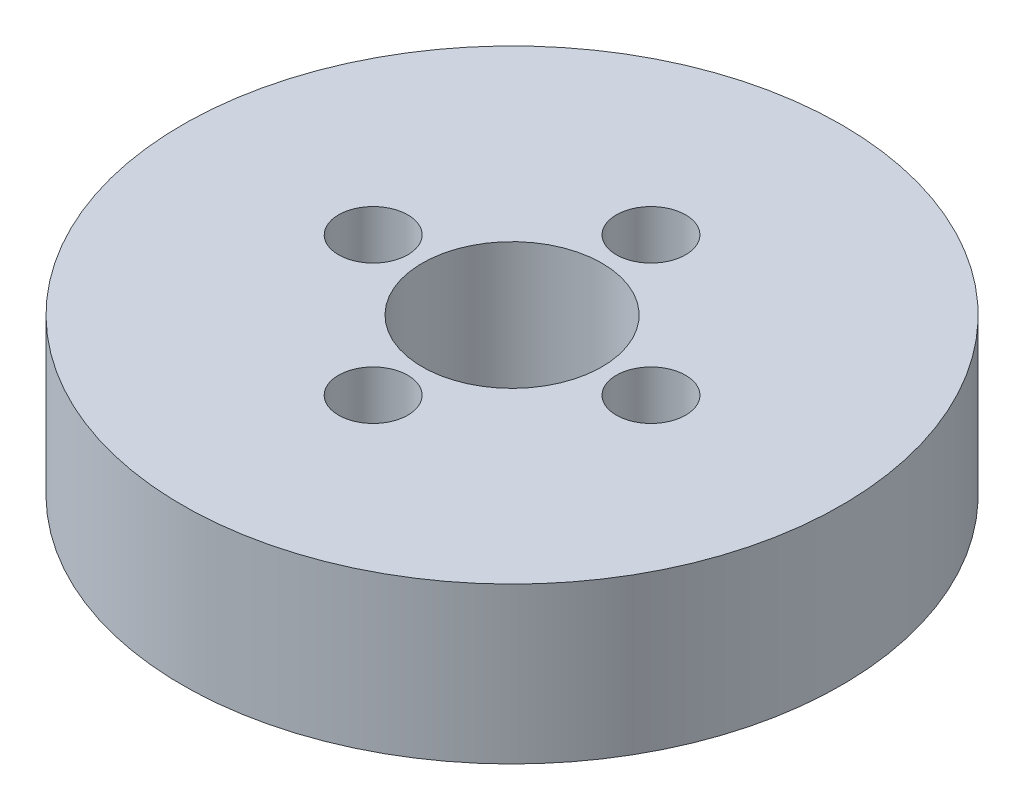
ISO-10303-21;
HEADER;
FILE_DESCRIPTION(('STEP AP214'),'2;1');
FILE_NAME('part.step','',(''),(''),'','','');
FILE_SCHEMA(('AUTOMOTIVE_DESIGN { 1 0 10303 214 1 1 1 1 }'));
ENDSEC;
DATA;
#1=APPLICATION_CONTEXT('core data for automotive mechanical design processes');
#2=APPLICATION_PROTOCOL_DEFINITION('international standard','automotive_design',2000,#1);
#3=PRODUCT_CONTEXT('',#1,'mechanical');
#4=PRODUCT('Part','Part','',(#3));
#5=PRODUCT_RELATED_PRODUCT_CATEGORY('part','',(#4));
#6=PRODUCT_DEFINITION_FORMATION('','',#4);
#7=PRODUCT_DEFINITION_CONTEXT('part definition',#1,'design');
#8=PRODUCT_DEFINITION('design','',#6,#7);
#9=PRODUCT_DEFINITION_SHAPE('','',#8);
#10=(LENGTH_UNIT() NAMED_UNIT(*) SI_UNIT(.MILLI.,.METRE.));
#11=(NAMED_UNIT(*) PLANE_ANGLE_UNIT() SI_UNIT($,.RADIAN.));
#12=(NAMED_UNIT(*) SI_UNIT($,.STERADIAN.) SOLID_ANGLE_UNIT());
#13=UNCERTAINTY_MEASURE_WITH_UNIT(LENGTH_MEASURE(1.E-05),#10,'distance_accuracy_value','');
#14=(GEOMETRIC_REPRESENTATION_CONTEXT(3) GLOBAL_UNCERTAINTY_ASSIGNED_CONTEXT((#13)) GLOBAL_UNIT_ASSIGNED_CONTEXT((#10,
#11,#12)) REPRESENTATION_CONTEXT('',''));
#15=CARTESIAN_POINT('',(0.,0.,0.));
#16=DIRECTION('',(0.,0.,1.));
#17=DIRECTION('',(1.,0.,0.));
#18=AXIS2_PLACEMENT_3D('',#15,#16,#17);
#19=CARTESIAN_POINT('',(0.,26.,0.));
#20=DIRECTION('',(0.,-1.,0.));
#21=DIRECTION('',(0.,0.,-1.));
#22=AXIS2_PLACEMENT_3D('',#19,#20,#21);
#23=CYLINDRICAL_SURFACE('',#22,55.);
#24=CARTESIAN_POINT('',(0.,26.,0.));
#25=DIRECTION('',(0.,1.,0.));
#26=DIRECTION('',(0.,0.,1.));
#27=AXIS2_PLACEMENT_3D('',#24,#25,#26);
#28=CIRCLE('',#27,55.);
#29=CARTESIAN_POINT('',(0.,26.,-55.));
#30=VERTEX_POINT('',#29);
#31=EDGE_CURVE('E10',#30,#30,#28,.T.);
#32=CARTESIAN_POINT('',(0.,0.,0.));
#33=DIRECTION('',(0.,1.,0.));
#34=DIRECTION('',(0.,0.,1.));
#35=AXIS2_PLACEMENT_3D('',#32,#33,#34);
#36=CIRCLE('',#35,55.);
#37=CARTESIAN_POINT('',(0.,0.,-55.));
#38=VERTEX_POINT('',#37);
#39=EDGE_CURVE('E37',#38,#38,#36,.T.);
#40=CARTESIAN_POINT('',(0.,26.,-55.));
#41=CARTESIAN_POINT('',(0.,25.7291666666667,-55.));
#42=CARTESIAN_POINT('',(0.,25.4583333333333,-55.));
#43=CARTESIAN_POINT('',(0.,24.9166666666667,-55.));
#44=CARTESIAN_POINT('',(0.,24.6458333333333,-55.));
#45=CARTESIAN_POINT('',(0.,24.1041666666667,-55.));
#46=CARTESIAN_POINT('',(0.,23.8333333333333,-55.));
#47=CARTESIAN_POINT('',(0.,23.2916666666667,-55.));
#48=CARTESIAN_POINT('',(0.,23.0208333333333,-55.));
#49=CARTESIAN_POINT('',(0.,22.4791666666667,-55.));
#50=CARTESIAN_POINT('',(0.,22.2083333333333,-55.));
#51=CARTESIAN_POINT('',(0.,21.6666666666667,-55.));
#52=CARTESIAN_POINT('',(0.,21.3958333333333,-55.));
#53=CARTESIAN_POINT('',(0.,20.8541666666667,-55.));
#54=CARTESIAN_POINT('',(0.,20.5833333333333,-55.));
#55=CARTESIAN_POINT('',(0.,20.0416666666667,-55.));
#56=CARTESIAN_POINT('',(0.,19.7708333333333,-55.));
#57=CARTESIAN_POINT('',(0.,19.2291666666667,-55.));
#58=CARTESIAN_POINT('',(0.,18.9583333333333,-55.));
#59=CARTESIAN_POINT('',(0.,18.4166666666667,-55.));
#60=CARTESIAN_POINT('',(0.,18.1458333333333,-55.));
#61=CARTESIAN_POINT('',(0.,17.6041666666667,-55.));
#62=CARTESIAN_POINT('',(0.,17.3333333333333,-55.));
#63=CARTESIAN_POINT('',(0.,16.7916666666667,-55.));
#64=CARTESIAN_POINT('',(0.,16.5208333333333,-55.));
#65=CARTESIAN_POINT('',(0.,15.9791666666667,-55.));
#66=CARTESIAN_POINT('',(0.,15.7083333333333,-55.));
#67=CARTESIAN_POINT('',(0.,15.1666666666667,-55.));
#68=CARTESIAN_POINT('',(0.,14.8958333333333,-55.));
#69=CARTESIAN_POINT('',(0.,14.3541666666667,-55.));
#70=CARTESIAN_POINT('',(0.,14.0833333333333,-55.));
#71=CARTESIAN_POINT('',(0.,13.5416666666667,-55.));
#72=CARTESIAN_POINT('',(0.,13.2708333333333,-55.));
#73=CARTESIAN_POINT('',(0.,12.7291666666667,-55.));
#74=CARTESIAN_POINT('',(0.,12.4583333333333,-55.));
#75=CARTESIAN_POINT('',(0.,11.9166666666667,-55.));
#76=CARTESIAN_POINT('',(0.,11.6458333333333,-55.));
#77=CARTESIAN_POINT('',(0.,11.1041666666667,-55.));
#78=CARTESIAN_POINT('',(0.,10.8333333333333,-55.));
#79=CARTESIAN_POINT('',(0.,10.2916666666667,-55.));
#80=CARTESIAN_POINT('',(0.,10.0208333333333,-55.));
#81=CARTESIAN_POINT('',(0.,9.47916666666667,-55.));
#82=CARTESIAN_POINT('',(0.,9.20833333333333,-55.));
#83=CARTESIAN_POINT('',(0.,8.66666666666667,-55.));
#84=CARTESIAN_POINT('',(0.,8.39583333333333,-55.));
#85=CARTESIAN_POINT('',(0.,7.85416666666667,-55.));
#86=CARTESIAN_POINT('',(0.,7.58333333333333,-55.));
#87=CARTESIAN_POINT('',(0.,7.04166666666667,-55.));
#88=CARTESIAN_POINT('',(0.,6.77083333333333,-55.));
#89=CARTESIAN_POINT('',(0.,6.22916666666667,-55.));
#90=CARTESIAN_POINT('',(0.,5.95833333333333,-55.));
#91=CARTESIAN_POINT('',(0.,5.41666666666667,-55.));
#92=CARTESIAN_POINT('',(0.,5.14583333333333,-55.));
#93=CARTESIAN_POINT('',(0.,4.60416666666667,-55.));
#94=CARTESIAN_POINT('',(0.,4.33333333333333,-55.));
#95=CARTESIAN_POINT('',(0.,3.79166666666667,-55.));
#96=CARTESIAN_POINT('',(0.,3.52083333333333,-55.));
#97=CARTESIAN_POINT('',(0.,2.97916666666667,-55.));
#98=CARTESIAN_POINT('',(0.,2.70833333333333,-55.));
#99=CARTESIAN_POINT('',(0.,2.16666666666667,-55.));
#100=CARTESIAN_POINT('',(0.,1.89583333333333,-55.));
#101=CARTESIAN_POINT('',(0.,1.35416666666667,-55.));
#102=CARTESIAN_POINT('',(0.,1.08333333333333,-55.));
#103=CARTESIAN_POINT('',(0.,0.541666666666667,-55.));
#104=CARTESIAN_POINT('',(0.,0.270833333333334,-55.));
#105=CARTESIAN_POINT('',(0.,0.,-55.));
#106=B_SPLINE_CURVE_WITH_KNOTS('',3,(#40,#41,#42,#43,#44,#45,#46,#47,#48,#49,#50,#51,#52,#53,
#54,#55,#56,#57,#58,#59,#60,#61,#62,#63,#64,#65,#66,#67,#68,#69,#70,#71,#72,#73,#74,#75,#76,#77,
#78,#79,#80,#81,#82,#83,#84,#85,#86,#87,#88,#89,#90,#91,#92,#93,#94,#95,#96,#97,#98,#99,#100,
#101,#102,#103,#104,#105),.UNSPECIFIED.,.F.,.F.,(4,2,2,2,2,2,2,2,2,2,2,2,2,2,2,2,2,2,2,2,2,2,2,
2,2,2,2,2,2,2,2,2,4),(0.,0.812500000000001,1.625,2.4375,3.25,4.0625,4.875,5.6875,6.5,7.3125,
8.125,8.9375,9.75,10.5625,11.375,12.1875,13.,13.8125,14.625,15.4375,16.25,17.0625,17.875,
18.6875,19.5,20.3125,21.125,21.9375,22.75,23.5625,24.375,25.1875,26.),.UNSPECIFIED.);
#107=EDGE_CURVE('BSEAM40',#30,#38,#106,.T.);
#108=ORIENTED_EDGE('',*,*,#31,.F.);
#109=ORIENTED_EDGE('',*,*,#39,.T.);
#110=ORIENTED_EDGE('',*,*,#107,.T.);
#111=ORIENTED_EDGE('',*,*,#107,.F.);
#112=EDGE_LOOP('',(#108,#110,#109,#111));
#113=FACE_BOUND('',#112,.T.);
#114=ADVANCED_FACE('F40',(#113),#23,.T.);
#115=CARTESIAN_POINT('',(0.,26.,0.));
#116=DIRECTION('',(0.,1.,0.));
#117=DIRECTION('',(0.,0.,1.));
#118=AXIS2_PLACEMENT_3D('',#115,#116,#117);
#119=PLANE('',#118);
#120=CARTESIAN_POINT('',(0.,26.,23.1811351570691));
#121=DIRECTION('',(0.,1.,0.));
#122=DIRECTION('',(1.,0.,0.));
#123=AXIS2_PLACEMENT_3D('',#120,#121,#122);
#124=CIRCLE('',#123,5.78191735865765);
#125=CARTESIAN_POINT('',(5.78191735865773,26.,23.1811351570691));
#126=VERTEX_POINT('',#125);
#127=EDGE_CURVE('E71',#126,#126,#124,.T.);
#128=ORIENTED_EDGE('',*,*,#127,.F.);
#129=EDGE_LOOP('',(#128));
#130=FACE_BOUND('',#129,.T.);
#131=CARTESIAN_POINT('',(23.1811351570691,26.,0.));
#132=DIRECTION('',(0.,1.,0.));
#133=DIRECTION('',(0.,0.,-1.));
#134=AXIS2_PLACEMENT_3D('',#131,#132,#133);
#135=CIRCLE('',#134,5.78191735865765);
#136=CARTESIAN_POINT('',(23.1811351570691,26.,-5.78191735865765));
#137=VERTEX_POINT('',#136);
#138=EDGE_CURVE('E70',#137,#137,#135,.T.);
#139=ORIENTED_EDGE('',*,*,#138,.F.);
#140=EDGE_LOOP('',(#139));
#141=FACE_BOUND('',#140,.T.);
#142=CARTESIAN_POINT('',(-2.42809502442321E-13,26.,-23.1811351570691));
#143=DIRECTION('',(0.,1.,0.));
#144=DIRECTION('',(-1.,0.,0.));
#145=AXIS2_PLACEMENT_3D('',#142,#143,#144);
#146=CIRCLE('',#145,5.78191735865765);
#147=CARTESIAN_POINT('',(-5.7819173586579,26.,-23.181135157069));
#148=VERTEX_POINT('',#147);
#149=EDGE_CURVE('E61',#148,#148,#146,.T.);
#150=ORIENTED_EDGE('',*,*,#149,.F.);
#151=EDGE_LOOP('',(#150));
#152=FACE_BOUND('',#151,.T.);
#153=CARTESIAN_POINT('',(-23.1811351570691,26.,0.));
#154=DIRECTION('',(0.,1.,0.));
#155=DIRECTION('',(0.,0.,1.));
#156=AXIS2_PLACEMENT_3D('',#153,#154,#155);
#157=CIRCLE('',#156,5.78191735865765);
#158=CARTESIAN_POINT('',(-23.1811351570691,26.,5.78191735865765));
#159=VERTEX_POINT('',#158);
#160=EDGE_CURVE('E54',#159,#159,#157,.T.);
#161=ORIENTED_EDGE('',*,*,#160,.F.);
#162=EDGE_LOOP('',(#161));
#163=FACE_BOUND('',#162,.T.);
#164=CARTESIAN_POINT('',(0.,26.,0.));
#165=DIRECTION('',(0.,1.,0.));
#166=DIRECTION('',(0.,0.,1.));
#167=AXIS2_PLACEMENT_3D('',#164,#165,#166);
#168=CIRCLE('',#167,15.);
#169=CARTESIAN_POINT('',(0.,26.,-15.));
#170=VERTEX_POINT('',#169);
#171=EDGE_CURVE('E50',#170,#170,#168,.T.);
#172=ORIENTED_EDGE('',*,*,#171,.F.);
#173=EDGE_LOOP('',(#172));
#174=FACE_BOUND('',#173,.T.);
#175=ORIENTED_EDGE('',*,*,#31,.T.);
#176=EDGE_LOOP('',(#175));
#177=FACE_BOUND('',#176,.T.);
#178=ADVANCED_FACE('F86',(#130,#141,#152,#163,#174,#177),#119,.T.);
#179=CARTESIAN_POINT('',(0.,0.,0.));
#180=DIRECTION('',(0.,1.,0.));
#181=DIRECTION('',(0.,0.,1.));
#182=AXIS2_PLACEMENT_3D('',#179,#180,#181);
#183=PLANE('',#182);
#184=CARTESIAN_POINT('',(0.,0.,0.));
#185=DIRECTION('',(0.,1.,0.));
#186=DIRECTION('',(0.,0.,1.));
#187=AXIS2_PLACEMENT_3D('',#184,#185,#186);
#188=CIRCLE('',#187,15.);
#189=CARTESIAN_POINT('',(0.,0.,-15.));
#190=VERTEX_POINT('',#189);
#191=EDGE_CURVE('E47',#190,#190,#188,.T.);
#192=ORIENTED_EDGE('',*,*,#191,.T.);
#193=EDGE_LOOP('',(#192));
#194=FACE_BOUND('',#193,.T.);
#195=ORIENTED_EDGE('',*,*,#39,.F.);
#196=EDGE_LOOP('',(#195));
#197=FACE_BOUND('',#196,.T.);
#198=ADVANCED_FACE('F93',(#194,#197),#183,.F.);
#199=CARTESIAN_POINT('',(0.,26.,0.));
#200=DIRECTION('',(0.,-1.,0.));
#201=DIRECTION('',(0.,0.,-1.));
#202=AXIS2_PLACEMENT_3D('',#199,#200,#201);
#203=CYLINDRICAL_SURFACE('',#202,15.);
#204=CARTESIAN_POINT('',(0.,26.,-15.));
#205=CARTESIAN_POINT('',(0.,25.7291666666667,-15.));
#206=CARTESIAN_POINT('',(0.,25.4583333333333,-15.));
#207=CARTESIAN_POINT('',(0.,24.9166666666667,-15.));
#208=CARTESIAN_POINT('',(0.,24.6458333333333,-15.));
#209=CARTESIAN_POINT('',(0.,24.1041666666667,-15.));
#210=CARTESIAN_POINT('',(0.,23.8333333333333,-15.));
#211=CARTESIAN_POINT('',(0.,23.2916666666667,-15.));
#212=CARTESIAN_POINT('',(0.,23.0208333333333,-15.));
#213=CARTESIAN_POINT('',(0.,22.4791666666667,-15.));
#214=CARTESIAN_POINT('',(0.,22.2083333333333,-15.));
#215=CARTESIAN_POINT('',(0.,21.6666666666667,-15.));
#216=CARTESIAN_POINT('',(0.,21.3958333333333,-15.));
#217=CARTESIAN_POINT('',(0.,20.8541666666667,-15.));
#218=CARTESIAN_POINT('',(0.,20.5833333333333,-15.));
#219=CARTESIAN_POINT('',(0.,20.0416666666667,-15.));
#220=CARTESIAN_POINT('',(0.,19.7708333333333,-15.));
#221=CARTESIAN_POINT('',(0.,19.2291666666667,-15.));
#222=CARTESIAN_POINT('',(0.,18.9583333333333,-15.));
#223=CARTESIAN_POINT('',(0.,18.4166666666667,-15.));
#224=CARTESIAN_POINT('',(0.,18.1458333333333,-15.));
#225=CARTESIAN_POINT('',(0.,17.6041666666667,-15.));
#226=CARTESIAN_POINT('',(0.,17.3333333333333,-15.));
#227=CARTESIAN_POINT('',(0.,16.7916666666667,-15.));
#228=CARTESIAN_POINT('',(0.,16.5208333333333,-15.));
#229=CARTESIAN_POINT('',(0.,15.9791666666667,-15.));
#230=CARTESIAN_POINT('',(0.,15.7083333333333,-15.));
#231=CARTESIAN_POINT('',(0.,15.1666666666667,-15.));
#232=CARTESIAN_POINT('',(0.,14.8958333333333,-15.));
#233=CARTESIAN_POINT('',(0.,14.3541666666667,-15.));
#234=CARTESIAN_POINT('',(0.,14.0833333333333,-15.));
#235=CARTESIAN_POINT('',(0.,13.5416666666667,-15.));
#236=CARTESIAN_POINT('',(0.,13.2708333333333,-15.));
#237=CARTESIAN_POINT('',(0.,12.7291666666667,-15.));
#238=CARTESIAN_POINT('',(0.,12.4583333333333,-15.));
#239=CARTESIAN_POINT('',(0.,11.9166666666667,-15.));
#240=CARTESIAN_POINT('',(0.,11.6458333333333,-15.));
#241=CARTESIAN_POINT('',(0.,11.1041666666667,-15.));
#242=CARTESIAN_POINT('',(0.,10.8333333333333,-15.));
#243=CARTESIAN_POINT('',(0.,10.2916666666667,-15.));
#244=CARTESIAN_POINT('',(0.,10.0208333333333,-15.));
#245=CARTESIAN_POINT('',(0.,9.47916666666667,-15.));
#246=CARTESIAN_POINT('',(0.,9.20833333333333,-15.));
#247=CARTESIAN_POINT('',(0.,8.66666666666667,-15.));
#248=CARTESIAN_POINT('',(0.,8.39583333333333,-15.));
#249=CARTESIAN_POINT('',(0.,7.85416666666667,-15.));
#250=CARTESIAN_POINT('',(0.,7.58333333333333,-15.));
#251=CARTESIAN_POINT('',(0.,7.04166666666667,-15.));
#252=CARTESIAN_POINT('',(0.,6.77083333333333,-15.));
#253=CARTESIAN_POINT('',(0.,6.22916666666667,-15.));
#254=CARTESIAN_POINT('',(0.,5.95833333333333,-15.));
#255=CARTESIAN_POINT('',(0.,5.41666666666667,-15.));
#256=CARTESIAN_POINT('',(0.,5.14583333333333,-15.));
#257=CARTESIAN_POINT('',(0.,4.60416666666667,-15.));
#258=CARTESIAN_POINT('',(0.,4.33333333333333,-15.));
#259=CARTESIAN_POINT('',(0.,3.79166666666667,-15.));
#260=CARTESIAN_POINT('',(0.,3.52083333333333,-15.));
#261=CARTESIAN_POINT('',(0.,2.97916666666667,-15.));
#262=CARTESIAN_POINT('',(0.,2.70833333333333,-15.));
#263=CARTESIAN_POINT('',(0.,2.16666666666667,-15.));
#264=CARTESIAN_POINT('',(0.,1.89583333333333,-15.));
#265=CARTESIAN_POINT('',(0.,1.35416666666667,-15.));
#266=CARTESIAN_POINT('',(0.,1.08333333333333,-15.));
#267=CARTESIAN_POINT('',(0.,0.541666666666667,-15.));
#268=CARTESIAN_POINT('',(0.,0.270833333333334,-15.));
#269=CARTESIAN_POINT('',(0.,0.,-15.));
#270=B_SPLINE_CURVE_WITH_KNOTS('',3,(#204,#205,#206,#207,#208,#209,#210,#211,#212,#213,#214,
#215,#216,#217,#218,#219,#220,#221,#222,#223,#224,#225,#226,#227,#228,#229,#230,#231,#232,#233,
#234,#235,#236,#237,#238,#239,#240,#241,#242,#243,#244,#245,#246,#247,#248,#249,#250,#251,#252,
#253,#254,#255,#256,#257,#258,#259,#260,#261,#262,#263,#264,#265,#266,#267,#268,#269),
.UNSPECIFIED.,.F.,.F.,(4,2,2,2,2,2,2,2,2,2,2,2,2,2,2,2,2,2,2,2,2,2,2,2,2,2,2,2,2,2,2,2,4),(0.,
0.812500000000001,1.625,2.4375,3.25,4.0625,4.875,5.6875,6.5,7.3125,8.125,8.9375,9.75,10.5625,
11.375,12.1875,13.,13.8125,14.625,15.4375,16.25,17.0625,17.875,18.6875,19.5,20.3125,21.125,
21.9375,22.75,23.5625,24.375,25.1875,26.),.UNSPECIFIED.);
#271=EDGE_CURVE('BSEAM101',#170,#190,#270,.T.);
#272=ORIENTED_EDGE('',*,*,#171,.T.);
#273=ORIENTED_EDGE('',*,*,#191,.F.);
#274=ORIENTED_EDGE('',*,*,#271,.T.);
#275=ORIENTED_EDGE('',*,*,#271,.F.);
#276=EDGE_LOOP('',(#272,#274,#273,#275));
#277=FACE_BOUND('',#276,.T.);
#278=ADVANCED_FACE('F101',(#277),#203,.F.);
#279=CARTESIAN_POINT('',(-23.1811351570691,1.56405362331572,0.));
#280=DIRECTION('',(0.,1.,0.));
#281=DIRECTION('',(0.,0.,1.));
#282=AXIS2_PLACEMENT_3D('',#279,#280,#281);
#283=CYLINDRICAL_SURFACE('',#282,5.78191735865765);
#284=CARTESIAN_POINT('',(-23.1811351570691,1.56405362331572,0.));
#285=DIRECTION('',(0.,1.,0.));
#286=DIRECTION('',(0.,0.,1.));
#287=AXIS2_PLACEMENT_3D('',#284,#285,#286);
#288=CIRCLE('',#287,5.78191735865765);
#289=CARTESIAN_POINT('',(-23.1811351570691,1.56405362331572,5.78191735865765));
#290=VERTEX_POINT('',#289);
#291=EDGE_CURVE('E55',#290,#290,#288,.T.);
#292=ORIENTED_EDGE('',*,*,#291,.F.);
#293=EDGE_LOOP('',(#292));
#294=FACE_BOUND('',#293,.T.);
#295=ORIENTED_EDGE('',*,*,#160,.T.);
#296=EDGE_LOOP('',(#295));
#297=FACE_BOUND('',#296,.T.);
#298=ADVANCED_FACE('F102',(#294,#297),#283,.F.);
#299=CARTESIAN_POINT('',(-23.1811351570691,1.56405362331572,0.));
#300=DIRECTION('',(0.,1.,0.));
#301=DIRECTION('',(0.,0.,1.));
#302=AXIS2_PLACEMENT_3D('',#299,#300,#301);
#303=PLANE('',#302);
#304=ORIENTED_EDGE('',*,*,#291,.T.);
#305=EDGE_LOOP('',(#304));
#306=FACE_BOUND('',#305,.T.);
#307=ADVANCED_FACE('F133',(#306),#303,.T.);
#308=CARTESIAN_POINT('',(-2.42809502442321E-13,1.56405362331572,-23.1811351570691));
#309=DIRECTION('',(0.,1.,0.));
#310=DIRECTION('',(0.,0.,1.));
#311=AXIS2_PLACEMENT_3D('',#308,#309,#310);
#312=CYLINDRICAL_SURFACE('',#311,5.78191735865765);
#313=CARTESIAN_POINT('',(-2.42809502442321E-13,1.56405362331572,-23.1811351570691));
#314=DIRECTION('',(0.,1.,0.));
#315=DIRECTION('',(-1.,0.,0.));
#316=AXIS2_PLACEMENT_3D('',#313,#314,#315);
#317=CIRCLE('',#316,5.78191735865765);
#318=CARTESIAN_POINT('',(-5.7819173586579,1.56405362331572,-23.181135157069));
#319=VERTEX_POINT('',#318);
#320=EDGE_CURVE('E63',#319,#319,#317,.T.);
#321=ORIENTED_EDGE('',*,*,#320,.F.);
#322=EDGE_LOOP('',(#321));
#323=FACE_BOUND('',#322,.T.);
#324=ORIENTED_EDGE('',*,*,#149,.T.);
#325=EDGE_LOOP('',(#324));
#326=FACE_BOUND('',#325,.T.);
#327=ADVANCED_FACE('F142',(#323,#326),#312,.F.);
#328=CARTESIAN_POINT('',(-2.42809502442321E-13,1.56405362331572,-23.1811351570691));
#329=DIRECTION('',(0.,1.,0.));
#330=DIRECTION('',(-1.,0.,0.));
#331=AXIS2_PLACEMENT_3D('',#328,#329,#330);
#332=PLANE('',#331);
#333=ORIENTED_EDGE('',*,*,#320,.T.);
#334=EDGE_LOOP('',(#333));
#335=FACE_BOUND('',#334,.T.);
#336=ADVANCED_FACE('F156',(#335),#332,.T.);
#337=CARTESIAN_POINT('',(23.1811351570691,1.56405362331572,0.));
#338=DIRECTION('',(0.,1.,0.));
#339=DIRECTION('',(0.,0.,1.));
#340=AXIS2_PLACEMENT_3D('',#337,#338,#339);
#341=CYLINDRICAL_SURFACE('',#340,5.78191735865765);
#342=CARTESIAN_POINT('',(23.1811351570691,1.56405362331572,0.));
#343=DIRECTION('',(0.,1.,0.));
#344=DIRECTION('',(0.,0.,-1.));
#345=AXIS2_PLACEMENT_3D('',#342,#343,#344);
#346=CIRCLE('',#345,5.78191735865765);
#347=CARTESIAN_POINT('',(23.1811351570691,1.56405362331572,-5.78191735865765));
#348=VERTEX_POINT('',#347);
#349=EDGE_CURVE('E69',#348,#348,#346,.T.);
#350=ORIENTED_EDGE('',*,*,#349,.F.);
#351=EDGE_LOOP('',(#350));
#352=FACE_BOUND('',#351,.T.);
#353=ORIENTED_EDGE('',*,*,#138,.T.);
#354=EDGE_LOOP('',(#353));
#355=FACE_BOUND('',#354,.T.);
#356=ADVANCED_FACE('F164',(#352,#355),#341,.F.);
#357=CARTESIAN_POINT('',(23.1811351570691,1.56405362331572,0.));
#358=DIRECTION('',(0.,1.,0.));
#359=DIRECTION('',(0.,0.,-1.));
#360=AXIS2_PLACEMENT_3D('',#357,#358,#359);
#361=PLANE('',#360);
#362=ORIENTED_EDGE('',*,*,#349,.T.);
#363=EDGE_LOOP('',(#362));
#364=FACE_BOUND('',#363,.T.);
#365=ADVANCED_FACE('F83',(#364),#361,.T.);
#366=CARTESIAN_POINT('',(0.,1.56405362331572,23.1811351570691));
#367=DIRECTION('',(0.,1.,0.));
#368=DIRECTION('',(0.,0.,1.));
#369=AXIS2_PLACEMENT_3D('',#366,#367,#368);
#370=CYLINDRICAL_SURFACE('',#369,5.78191735865765);
#371=CARTESIAN_POINT('',(0.,1.56405362331572,23.1811351570691));
#372=DIRECTION('',(0.,1.,0.));
#373=DIRECTION('',(1.,0.,0.));
#374=AXIS2_PLACEMENT_3D('',#371,#372,#373);
#375=CIRCLE('',#374,5.78191735865765);
#376=CARTESIAN_POINT('',(5.78191735865773,1.56405362331572,23.1811351570691));
#377=VERTEX_POINT('',#376);
#378=EDGE_CURVE('E59',#377,#377,#375,.T.);
#379=ORIENTED_EDGE('',*,*,#378,.F.);
#380=EDGE_LOOP('',(#379));
#381=FACE_BOUND('',#380,.T.);
#382=ORIENTED_EDGE('',*,*,#127,.T.);
#383=EDGE_LOOP('',(#382));
#384=FACE_BOUND('',#383,.T.);
#385=ADVANCED_FACE('F81',(#381,#384),#370,.F.);
#386=CARTESIAN_POINT('',(0.,1.56405362331572,23.1811351570691));
#387=DIRECTION('',(0.,1.,0.));
#388=DIRECTION('',(1.,0.,0.));
#389=AXIS2_PLACEMENT_3D('',#386,#387,#388);
#390=PLANE('',#389);
#391=ORIENTED_EDGE('',*,*,#378,.T.);
#392=EDGE_LOOP('',(#391));
#393=FACE_BOUND('',#392,.T.);
#394=ADVANCED_FACE('F78',(#393),#390,.T.);
#395=CLOSED_SHELL('',(#114,#178,#198,#278,#298,#307,#327,#336,#356,#365,#385,#394));
#396=MANIFOLD_SOLID_BREP('B2',#395);
#397=ADVANCED_BREP_SHAPE_REPRESENTATION('',(#18,#396),#14);
#398=SHAPE_DEFINITION_REPRESENTATION(#9,#397);
ENDSEC;
END-ISO-10303-21;
